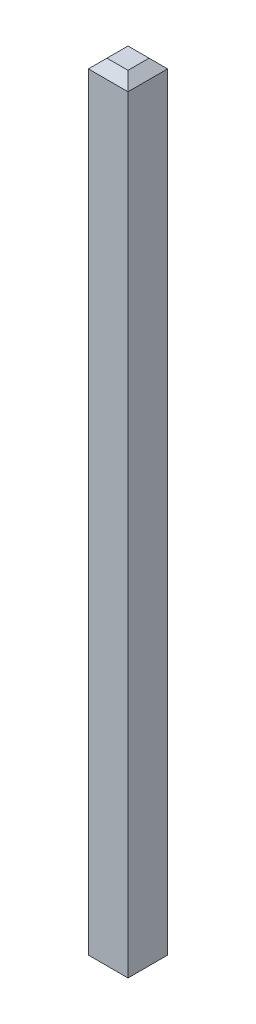
ISO-10303-21;
HEADER;
FILE_DESCRIPTION(('STEP AP214'),'2;1');
FILE_NAME('part.step','',(''),(''),'','','');
FILE_SCHEMA(('AUTOMOTIVE_DESIGN { 1 0 10303 214 1 1 1 1 }'));
ENDSEC;
DATA;
#1=APPLICATION_CONTEXT('core data for automotive mechanical design processes');
#2=APPLICATION_PROTOCOL_DEFINITION('international standard','automotive_design',2000,#1);
#3=PRODUCT_CONTEXT('',#1,'mechanical');
#4=PRODUCT('Part','Part','',(#3));
#5=PRODUCT_RELATED_PRODUCT_CATEGORY('part','',(#4));
#6=PRODUCT_DEFINITION_FORMATION('','',#4);
#7=PRODUCT_DEFINITION_CONTEXT('part definition',#1,'design');
#8=PRODUCT_DEFINITION('design','',#6,#7);
#9=PRODUCT_DEFINITION_SHAPE('','',#8);
#10=(LENGTH_UNIT() NAMED_UNIT(*) SI_UNIT(.MILLI.,.METRE.));
#11=(NAMED_UNIT(*) PLANE_ANGLE_UNIT() SI_UNIT($,.RADIAN.));
#12=(NAMED_UNIT(*) SI_UNIT($,.STERADIAN.) SOLID_ANGLE_UNIT());
#13=UNCERTAINTY_MEASURE_WITH_UNIT(LENGTH_MEASURE(1.E-05),#10,'distance_accuracy_value','');
#14=(GEOMETRIC_REPRESENTATION_CONTEXT(3) GLOBAL_UNCERTAINTY_ASSIGNED_CONTEXT((#13)) GLOBAL_UNIT_ASSIGNED_CONTEXT((#10,
#11,#12)) REPRESENTATION_CONTEXT('',''));
#15=CARTESIAN_POINT('',(0.,0.,0.));
#16=DIRECTION('',(0.,0.,1.));
#17=DIRECTION('',(1.,0.,0.));
#18=AXIS2_PLACEMENT_3D('',#15,#16,#17);
#19=CARTESIAN_POINT('',(-2.785,-1.925,-0.16));
#20=DIRECTION('',(-0.707106781186548,-0.707106781186548,0.));
#21=DIRECTION('',(0.707106781186548,-0.707106781186548,0.));
#22=AXIS2_PLACEMENT_3D('',#19,#20,#21);
#23=PLANE('',#22);
#24=DIRECTION('',(0.,0.,1.));
#25=VECTOR('',#24,1.);
#26=CARTESIAN_POINT('',(-2.86,-1.85,-0.32));
#27=LINE('',#26,#25);
#28=CARTESIAN_POINT('',(-2.86,-1.85,-0.32));
#29=VERTEX_POINT('',#28);
#30=CARTESIAN_POINT('',(-2.86,-1.85,0.32));
#31=VERTEX_POINT('',#30);
#32=EDGE_CURVE('E96',#29,#31,#27,.T.);
#33=ORIENTED_EDGE('',*,*,#32,.F.);
#34=DIRECTION('',(-0.577350269189626,0.577350269189626,-0.577350269189625));
#35=VECTOR('',#34,1.);
#36=CARTESIAN_POINT('',(-2.71,-2.,-0.17));
#37=LINE('',#36,#35);
#38=CARTESIAN_POINT('',(-2.71,-2.,-0.17));
#39=VERTEX_POINT('',#38);
#40=EDGE_CURVE('E94',#39,#29,#37,.T.);
#41=ORIENTED_EDGE('',*,*,#40,.F.);
#42=DIRECTION('',(0.,0.,1.));
#43=VECTOR('',#42,1.);
#44=CARTESIAN_POINT('',(-2.71,-2.,0.));
#45=LINE('',#44,#43);
#46=CARTESIAN_POINT('',(-2.71,-2.,0.17));
#47=VERTEX_POINT('',#46);
#48=EDGE_CURVE('E20',#39,#47,#45,.T.);
#49=ORIENTED_EDGE('',*,*,#48,.T.);
#50=DIRECTION('',(0.577350269189626,-0.577350269189626,-0.577350269189625));
#51=VECTOR('',#50,1.);
#52=CARTESIAN_POINT('',(-2.86,-1.85,0.32));
#53=LINE('',#52,#51);
#54=EDGE_CURVE('E112',#31,#47,#53,.T.);
#55=ORIENTED_EDGE('',*,*,#54,.F.);
#56=EDGE_LOOP('',(#33,#41,#49,#55));
#57=FACE_BOUND('',#56,.T.);
#58=ADVANCED_FACE('F17',(#57),#23,.T.);
#59=CARTESIAN_POINT('',(-2.785,10.625,-0.16));
#60=DIRECTION('',(-0.707106781186545,0.70710678118655,0.));
#61=DIRECTION('',(-0.70710678118655,-0.707106781186545,0.));
#62=AXIS2_PLACEMENT_3D('',#59,#60,#61);
#63=PLANE('',#62);
#64=DIRECTION('',(0.,0.,1.));
#65=VECTOR('',#64,1.);
#66=CARTESIAN_POINT('',(-2.86,10.55,-0.32));
#67=LINE('',#66,#65);
#68=CARTESIAN_POINT('',(-2.86,10.55,0.32));
#69=VERTEX_POINT('',#68);
#70=CARTESIAN_POINT('',(-2.86,10.55,-0.32));
#71=VERTEX_POINT('',#70);
#72=EDGE_CURVE('E121',#69,#71,#67,.F.);
#73=ORIENTED_EDGE('',*,*,#72,.F.);
#74=DIRECTION('',(-0.577350269189627,-0.577350269189623,0.577350269189627));
#75=VECTOR('',#74,1.);
#76=CARTESIAN_POINT('',(-2.71,10.7,0.170000000000001));
#77=LINE('',#76,#75);
#78=CARTESIAN_POINT('',(-2.71,10.7,0.17));
#79=VERTEX_POINT('',#78);
#80=EDGE_CURVE('E118',#79,#69,#77,.T.);
#81=ORIENTED_EDGE('',*,*,#80,.F.);
#82=DIRECTION('',(0.,0.,1.));
#83=VECTOR('',#82,1.);
#84=CARTESIAN_POINT('',(-2.71,10.7,0.));
#85=LINE('',#84,#83);
#86=CARTESIAN_POINT('',(-2.71,10.7,-0.17));
#87=VERTEX_POINT('',#86);
#88=EDGE_CURVE('E79',#87,#79,#85,.T.);
#89=ORIENTED_EDGE('',*,*,#88,.F.);
#90=DIRECTION('',(0.577350269189627,0.577350269189623,0.577350269189627));
#91=VECTOR('',#90,1.);
#92=CARTESIAN_POINT('',(-2.86,10.55,-0.320000000000001));
#93=LINE('',#92,#91);
#94=EDGE_CURVE('E106',#71,#87,#93,.T.);
#95=ORIENTED_EDGE('',*,*,#94,.F.);
#96=EDGE_LOOP('',(#73,#81,#89,#95));
#97=FACE_BOUND('',#96,.T.);
#98=ADVANCED_FACE('F283',(#97),#63,.T.);
#99=CARTESIAN_POINT('',(-2.54,-2.,0.));
#100=DIRECTION('',(0.,1.,0.));
#101=DIRECTION('',(0.,0.,1.));
#102=AXIS2_PLACEMENT_3D('',#99,#100,#101);
#103=PLANE('',#102);
#104=DIRECTION('',(0.,0.,1.));
#105=VECTOR('',#104,1.);
#106=CARTESIAN_POINT('',(-2.37,-2.,0.16));
#107=LINE('',#106,#105);
#108=CARTESIAN_POINT('',(-2.37,-2.,0.17));
#109=VERTEX_POINT('',#108);
#110=CARTESIAN_POINT('',(-2.37,-2.,-0.17));
#111=VERTEX_POINT('',#110);
#112=EDGE_CURVE('E124',#109,#111,#107,.F.);
#113=ORIENTED_EDGE('',*,*,#112,.F.);
#114=DIRECTION('',(1.,0.,0.));
#115=VECTOR('',#114,1.);
#116=CARTESIAN_POINT('',(-2.7,-2.,0.17));
#117=LINE('',#116,#115);
#118=EDGE_CURVE('E90',#47,#109,#117,.T.);
#119=ORIENTED_EDGE('',*,*,#118,.F.);
#120=ORIENTED_EDGE('',*,*,#48,.F.);
#121=DIRECTION('',(1.,0.,0.));
#122=VECTOR('',#121,1.);
#123=CARTESIAN_POINT('',(-2.38,-2.,-0.17));
#124=LINE('',#123,#122);
#125=EDGE_CURVE('E87',#111,#39,#124,.F.);
#126=ORIENTED_EDGE('',*,*,#125,.F.);
#127=EDGE_LOOP('',(#113,#119,#120,#126));
#128=FACE_BOUND('',#127,.T.);
#129=ADVANCED_FACE('F85',(#128),#103,.F.);
#130=CARTESIAN_POINT('',(-2.38,-1.925,-0.245));
#131=DIRECTION('',(0.,-0.707106781186547,-0.707106781186548));
#132=DIRECTION('',(0.,0.707106781186548,-0.707106781186547));
#133=AXIS2_PLACEMENT_3D('',#130,#131,#132);
#134=PLANE('',#133);
#135=DIRECTION('',(-1.,0.,0.));
#136=VECTOR('',#135,1.);
#137=CARTESIAN_POINT('',(-2.22,-1.85,-0.32));
#138=LINE('',#137,#136);
#139=CARTESIAN_POINT('',(-2.22,-1.85,-0.32));
#140=VERTEX_POINT('',#139);
#141=EDGE_CURVE('E130',#140,#29,#138,.T.);
#142=ORIENTED_EDGE('',*,*,#141,.F.);
#143=DIRECTION('',(0.577350269189626,0.577350269189626,-0.577350269189626));
#144=VECTOR('',#143,1.);
#145=CARTESIAN_POINT('',(-2.37,-2.,-0.17));
#146=LINE('',#145,#144);
#147=EDGE_CURVE('E102',#111,#140,#146,.T.);
#148=ORIENTED_EDGE('',*,*,#147,.F.);
#149=ORIENTED_EDGE('',*,*,#125,.T.);
#150=ORIENTED_EDGE('',*,*,#40,.T.);
#151=EDGE_LOOP('',(#142,#148,#149,#150));
#152=FACE_BOUND('',#151,.T.);
#153=ADVANCED_FACE('F100',(#152),#134,.T.);
#154=CARTESIAN_POINT('',(-2.54,10.7,0.));
#155=DIRECTION('',(0.,1.,0.));
#156=DIRECTION('',(0.,0.,1.));
#157=AXIS2_PLACEMENT_3D('',#154,#155,#156);
#158=PLANE('',#157);
#159=ORIENTED_EDGE('',*,*,#88,.T.);
#160=DIRECTION('',(1.,0.,0.));
#161=VECTOR('',#160,1.);
#162=CARTESIAN_POINT('',(-2.7,10.7,0.170000000000001));
#163=LINE('',#162,#161);
#164=CARTESIAN_POINT('',(-2.37,10.7,0.17));
#165=VERTEX_POINT('',#164);
#166=EDGE_CURVE('E115',#165,#79,#163,.F.);
#167=ORIENTED_EDGE('',*,*,#166,.F.);
#168=DIRECTION('',(0.,0.,1.));
#169=VECTOR('',#168,1.);
#170=CARTESIAN_POINT('',(-2.37,10.7,0.16));
#171=LINE('',#170,#169);
#172=CARTESIAN_POINT('',(-2.37,10.7,-0.17));
#173=VERTEX_POINT('',#172);
#174=EDGE_CURVE('E139',#173,#165,#171,.T.);
#175=ORIENTED_EDGE('',*,*,#174,.F.);
#176=DIRECTION('',(1.,0.,0.));
#177=VECTOR('',#176,1.);
#178=CARTESIAN_POINT('',(-2.38,10.7,-0.170000000000001));
#179=LINE('',#178,#177);
#180=EDGE_CURVE('E109',#87,#173,#179,.T.);
#181=ORIENTED_EDGE('',*,*,#180,.F.);
#182=EDGE_LOOP('',(#159,#167,#175,#181));
#183=FACE_BOUND('',#182,.T.);
#184=ADVANCED_FACE('F259',(#183),#158,.T.);
#185=CARTESIAN_POINT('',(-2.38,10.625,-0.245));
#186=DIRECTION('',(0.,0.70710678118655,-0.707106781186545));
#187=DIRECTION('',(0.,0.707106781186545,0.70710678118655));
#188=AXIS2_PLACEMENT_3D('',#185,#186,#187);
#189=PLANE('',#188);
#190=ORIENTED_EDGE('',*,*,#180,.T.);
#191=DIRECTION('',(-0.577350269189626,0.577350269189624,0.577350269189628));
#192=VECTOR('',#191,1.);
#193=CARTESIAN_POINT('',(-2.22,10.55,-0.32));
#194=LINE('',#193,#192);
#195=CARTESIAN_POINT('',(-2.22,10.55,-0.32));
#196=VERTEX_POINT('',#195);
#197=EDGE_CURVE('E144',#196,#173,#194,.T.);
#198=ORIENTED_EDGE('',*,*,#197,.F.);
#199=DIRECTION('',(-1.,0.,0.));
#200=VECTOR('',#199,1.);
#201=CARTESIAN_POINT('',(-2.22,10.55,-0.32));
#202=LINE('',#201,#200);
#203=EDGE_CURVE('E136',#71,#196,#202,.F.);
#204=ORIENTED_EDGE('',*,*,#203,.F.);
#205=ORIENTED_EDGE('',*,*,#94,.T.);
#206=EDGE_LOOP('',(#190,#198,#204,#205));
#207=FACE_BOUND('',#206,.T.);
#208=ADVANCED_FACE('F251',(#207),#189,.T.);
#209=CARTESIAN_POINT('',(-2.7,-1.925,0.245));
#210=DIRECTION('',(0.,-0.707106781186547,0.707106781186548));
#211=DIRECTION('',(0.,-0.707106781186548,-0.707106781186547));
#212=AXIS2_PLACEMENT_3D('',#209,#210,#211);
#213=PLANE('',#212);
#214=ORIENTED_EDGE('',*,*,#118,.T.);
#215=DIRECTION('',(-0.577350269189626,-0.577350269189626,-0.577350269189626));
#216=VECTOR('',#215,1.);
#217=CARTESIAN_POINT('',(-2.22,-1.85,0.32));
#218=LINE('',#217,#216);
#219=CARTESIAN_POINT('',(-2.22,-1.85,0.32));
#220=VERTEX_POINT('',#219);
#221=EDGE_CURVE('E127',#220,#109,#218,.T.);
#222=ORIENTED_EDGE('',*,*,#221,.F.);
#223=DIRECTION('',(1.,0.,0.));
#224=VECTOR('',#223,1.);
#225=CARTESIAN_POINT('',(-2.86,-1.85,0.32));
#226=LINE('',#225,#224);
#227=EDGE_CURVE('E147',#31,#220,#226,.T.);
#228=ORIENTED_EDGE('',*,*,#227,.F.);
#229=ORIENTED_EDGE('',*,*,#54,.T.);
#230=EDGE_LOOP('',(#214,#222,#228,#229));
#231=FACE_BOUND('',#230,.T.);
#232=ADVANCED_FACE('F173',(#231),#213,.T.);
#233=CARTESIAN_POINT('',(-2.7,10.625,0.245));
#234=DIRECTION('',(0.,0.70710678118655,0.707106781186545));
#235=DIRECTION('',(0.,-0.707106781186545,0.70710678118655));
#236=AXIS2_PLACEMENT_3D('',#233,#234,#235);
#237=PLANE('',#236);
#238=DIRECTION('',(1.,0.,0.));
#239=VECTOR('',#238,1.);
#240=CARTESIAN_POINT('',(-2.86,10.55,0.32));
#241=LINE('',#240,#239);
#242=CARTESIAN_POINT('',(-2.22,10.55,0.32));
#243=VERTEX_POINT('',#242);
#244=EDGE_CURVE('E35',#243,#69,#241,.F.);
#245=ORIENTED_EDGE('',*,*,#244,.F.);
#246=DIRECTION('',(0.577350269189626,-0.577350269189624,0.577350269189628));
#247=VECTOR('',#246,1.);
#248=CARTESIAN_POINT('',(-2.37,10.7,0.17));
#249=LINE('',#248,#247);
#250=EDGE_CURVE('E142',#165,#243,#249,.T.);
#251=ORIENTED_EDGE('',*,*,#250,.F.);
#252=ORIENTED_EDGE('',*,*,#166,.T.);
#253=ORIENTED_EDGE('',*,*,#80,.T.);
#254=EDGE_LOOP('',(#245,#251,#252,#253));
#255=FACE_BOUND('',#254,.T.);
#256=ADVANCED_FACE('F190',(#255),#237,.T.);
#257=CARTESIAN_POINT('',(-2.86,-2.,-0.32));
#258=DIRECTION('',(-1.,0.,0.));
#259=DIRECTION('',(0.,0.,1.));
#260=AXIS2_PLACEMENT_3D('',#257,#258,#259);
#261=PLANE('',#260);
#262=ORIENTED_EDGE('',*,*,#72,.T.);
#263=DIRECTION('',(0.,1.,0.));
#264=VECTOR('',#263,1.);
#265=CARTESIAN_POINT('',(-2.86,-2.,-0.32));
#266=LINE('',#265,#264);
#267=EDGE_CURVE('E133',#29,#71,#266,.T.);
#268=ORIENTED_EDGE('',*,*,#267,.F.);
#269=ORIENTED_EDGE('',*,*,#32,.T.);
#270=DIRECTION('',(0.,1.,0.));
#271=VECTOR('',#270,1.);
#272=CARTESIAN_POINT('',(-2.86,-2.,0.32));
#273=LINE('',#272,#271);
#274=EDGE_CURVE('E151',#69,#31,#273,.F.);
#275=ORIENTED_EDGE('',*,*,#274,.F.);
#276=EDGE_LOOP('',(#262,#268,#269,#275));
#277=FACE_BOUND('',#276,.T.);
#278=ADVANCED_FACE('F176',(#277),#261,.T.);
#279=CARTESIAN_POINT('',(-2.295,-1.925,0.16));
#280=DIRECTION('',(0.707106781186548,-0.707106781186547,0.));
#281=DIRECTION('',(0.707106781186547,0.707106781186548,0.));
#282=AXIS2_PLACEMENT_3D('',#279,#280,#281);
#283=PLANE('',#282);
#284=DIRECTION('',(0.,0.,-1.));
#285=VECTOR('',#284,1.);
#286=CARTESIAN_POINT('',(-2.22,-1.85,0.32));
#287=LINE('',#286,#285);
#288=EDGE_CURVE('E154',#220,#140,#287,.T.);
#289=ORIENTED_EDGE('',*,*,#288,.F.);
#290=ORIENTED_EDGE('',*,*,#221,.T.);
#291=ORIENTED_EDGE('',*,*,#112,.T.);
#292=ORIENTED_EDGE('',*,*,#147,.T.);
#293=EDGE_LOOP('',(#289,#290,#291,#292));
#294=FACE_BOUND('',#293,.T.);
#295=ADVANCED_FACE('F181',(#294),#283,.T.);
#296=CARTESIAN_POINT('',(-2.22,-2.,-0.32));
#297=DIRECTION('',(0.,0.,-1.));
#298=DIRECTION('',(-1.,0.,0.));
#299=AXIS2_PLACEMENT_3D('',#296,#297,#298);
#300=PLANE('',#299);
#301=ORIENTED_EDGE('',*,*,#203,.T.);
#302=DIRECTION('',(0.,1.,0.));
#303=VECTOR('',#302,1.);
#304=CARTESIAN_POINT('',(-2.22,-2.,-0.32));
#305=LINE('',#304,#303);
#306=EDGE_CURVE('E157',#140,#196,#305,.T.);
#307=ORIENTED_EDGE('',*,*,#306,.F.);
#308=ORIENTED_EDGE('',*,*,#141,.T.);
#309=ORIENTED_EDGE('',*,*,#267,.T.);
#310=EDGE_LOOP('',(#301,#307,#308,#309));
#311=FACE_BOUND('',#310,.T.);
#312=ADVANCED_FACE('F179',(#311),#300,.T.);
#313=CARTESIAN_POINT('',(-2.295,10.625,0.16));
#314=DIRECTION('',(0.707106781186546,0.707106781186549,0.));
#315=DIRECTION('',(-0.707106781186549,0.707106781186546,0.));
#316=AXIS2_PLACEMENT_3D('',#313,#314,#315);
#317=PLANE('',#316);
#318=DIRECTION('',(0.,0.,-1.));
#319=VECTOR('',#318,1.);
#320=CARTESIAN_POINT('',(-2.22,10.55,0.32));
#321=LINE('',#320,#319);
#322=EDGE_CURVE('E26',#196,#243,#321,.F.);
#323=ORIENTED_EDGE('',*,*,#322,.F.);
#324=ORIENTED_EDGE('',*,*,#197,.T.);
#325=ORIENTED_EDGE('',*,*,#174,.T.);
#326=ORIENTED_EDGE('',*,*,#250,.T.);
#327=EDGE_LOOP('',(#323,#324,#325,#326));
#328=FACE_BOUND('',#327,.T.);
#329=ADVANCED_FACE('F167',(#328),#317,.T.);
#330=CARTESIAN_POINT('',(-2.86,-2.,0.32));
#331=DIRECTION('',(0.,0.,1.));
#332=DIRECTION('',(1.,0.,0.));
#333=AXIS2_PLACEMENT_3D('',#330,#331,#332);
#334=PLANE('',#333);
#335=ORIENTED_EDGE('',*,*,#244,.T.);
#336=ORIENTED_EDGE('',*,*,#274,.T.);
#337=ORIENTED_EDGE('',*,*,#227,.T.);
#338=DIRECTION('',(0.,1.,0.));
#339=VECTOR('',#338,1.);
#340=CARTESIAN_POINT('',(-2.22,-2.,0.32));
#341=LINE('',#340,#339);
#342=EDGE_CURVE('E11',#243,#220,#341,.F.);
#343=ORIENTED_EDGE('',*,*,#342,.F.);
#344=EDGE_LOOP('',(#335,#336,#337,#343));
#345=FACE_BOUND('',#344,.T.);
#346=ADVANCED_FACE('F169',(#345),#334,.T.);
#347=CARTESIAN_POINT('',(-2.22,-2.,0.32));
#348=DIRECTION('',(1.,0.,0.));
#349=DIRECTION('',(0.,0.,-1.));
#350=AXIS2_PLACEMENT_3D('',#347,#348,#349);
#351=PLANE('',#350);
#352=ORIENTED_EDGE('',*,*,#322,.T.);
#353=ORIENTED_EDGE('',*,*,#342,.T.);
#354=ORIENTED_EDGE('',*,*,#288,.T.);
#355=ORIENTED_EDGE('',*,*,#306,.T.);
#356=EDGE_LOOP('',(#352,#353,#354,#355));
#357=FACE_BOUND('',#356,.T.);
#358=ADVANCED_FACE('F163',(#357),#351,.T.);
#359=CLOSED_SHELL('',(#58,#98,#129,#153,#184,#208,#232,#256,#278,#295,#312,#329,#346,#358));
#360=MANIFOLD_SOLID_BREP('B1',#359);
#361=ADVANCED_BREP_SHAPE_REPRESENTATION('',(#18,#360),#14);
#362=SHAPE_DEFINITION_REPRESENTATION(#9,#361);
ENDSEC;
END-ISO-10303-21;
